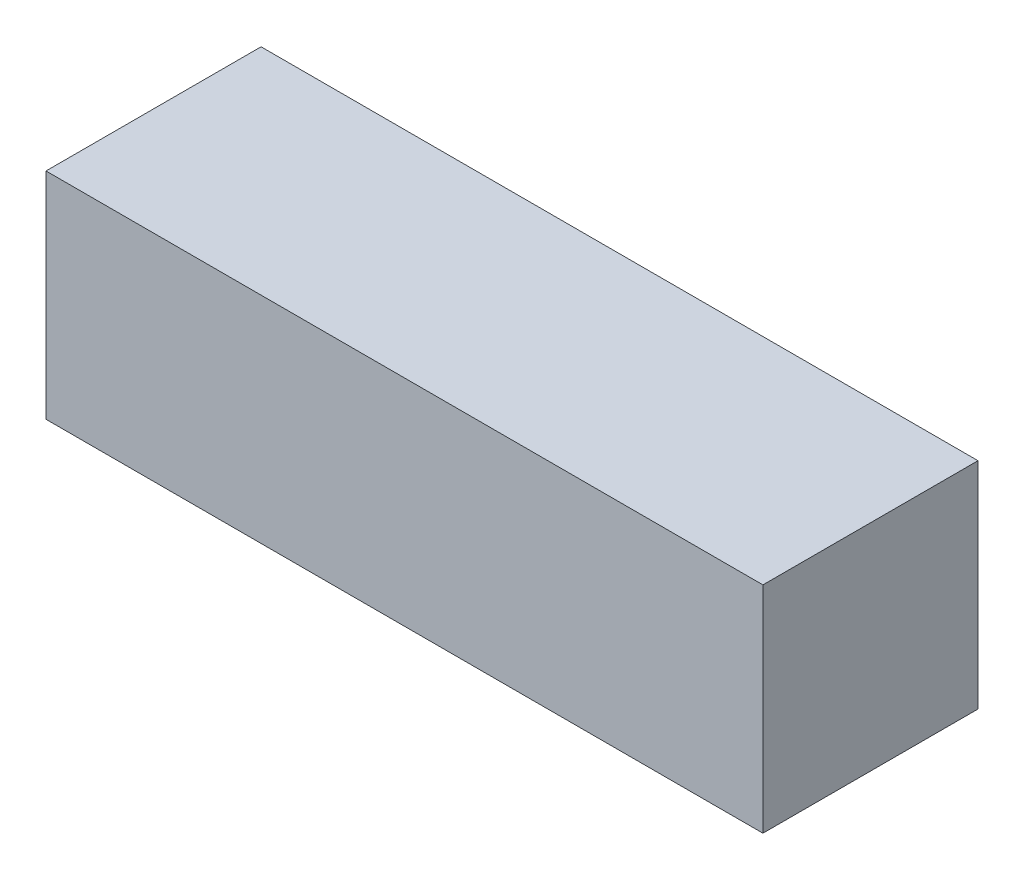
ISO-10303-21;
HEADER;
FILE_DESCRIPTION(('STEP AP214'),'2;1');
FILE_NAME('part.step','',(''),(''),'','','');
FILE_SCHEMA(('AUTOMOTIVE_DESIGN { 1 0 10303 214 1 1 1 1 }'));
ENDSEC;
DATA;
#1=APPLICATION_CONTEXT('core data for automotive mechanical design processes');
#2=APPLICATION_PROTOCOL_DEFINITION('international standard','automotive_design',2000,#1);
#3=PRODUCT_CONTEXT('',#1,'mechanical');
#4=PRODUCT('Part','Part','',(#3));
#5=PRODUCT_RELATED_PRODUCT_CATEGORY('part','',(#4));
#6=PRODUCT_DEFINITION_FORMATION('','',#4);
#7=PRODUCT_DEFINITION_CONTEXT('part definition',#1,'design');
#8=PRODUCT_DEFINITION('design','',#6,#7);
#9=PRODUCT_DEFINITION_SHAPE('','',#8);
#10=(LENGTH_UNIT() NAMED_UNIT(*) SI_UNIT(.MILLI.,.METRE.));
#11=(NAMED_UNIT(*) PLANE_ANGLE_UNIT() SI_UNIT($,.RADIAN.));
#12=(NAMED_UNIT(*) SI_UNIT($,.STERADIAN.) SOLID_ANGLE_UNIT());
#13=UNCERTAINTY_MEASURE_WITH_UNIT(LENGTH_MEASURE(1.E-05),#10,'distance_accuracy_value','');
#14=(GEOMETRIC_REPRESENTATION_CONTEXT(3) GLOBAL_UNCERTAINTY_ASSIGNED_CONTEXT((#13)) GLOBAL_UNIT_ASSIGNED_CONTEXT((#10,
#11,#12)) REPRESENTATION_CONTEXT('',''));
#15=CARTESIAN_POINT('',(0.,0.,0.));
#16=DIRECTION('',(0.,0.,1.));
#17=DIRECTION('',(1.,0.,0.));
#18=AXIS2_PLACEMENT_3D('',#15,#16,#17);
#19=CARTESIAN_POINT('',(100.,60.,30.));
#20=DIRECTION('',(-1.,0.,0.));
#21=DIRECTION('',(0.,0.,1.));
#22=AXIS2_PLACEMENT_3D('',#19,#20,#21);
#23=PLANE('',#22);
#24=DIRECTION('',(0.,0.,-1.));
#25=VECTOR('',#24,1.);
#26=CARTESIAN_POINT('',(100.,0.,30.));
#27=LINE('',#26,#25);
#28=CARTESIAN_POINT('',(100.,0.,30.));
#29=VERTEX_POINT('',#28);
#30=CARTESIAN_POINT('',(100.,0.,-30.));
#31=VERTEX_POINT('',#30);
#32=EDGE_CURVE('E113',#29,#31,#27,.T.);
#33=ORIENTED_EDGE('',*,*,#32,.T.);
#34=DIRECTION('',(0.,-1.,0.));
#35=VECTOR('',#34,1.);
#36=CARTESIAN_POINT('',(100.,60.,-30.));
#37=LINE('',#36,#35);
#38=CARTESIAN_POINT('',(100.,60.,-30.));
#39=VERTEX_POINT('',#38);
#40=EDGE_CURVE('E11',#39,#31,#37,.T.);
#41=ORIENTED_EDGE('',*,*,#40,.F.);
#42=DIRECTION('',(0.,0.,-1.));
#43=VECTOR('',#42,1.);
#44=CARTESIAN_POINT('',(100.,60.,30.));
#45=LINE('',#44,#43);
#46=CARTESIAN_POINT('',(100.,60.,30.));
#47=VERTEX_POINT('',#46);
#48=EDGE_CURVE('E97',#47,#39,#45,.T.);
#49=ORIENTED_EDGE('',*,*,#48,.F.);
#50=DIRECTION('',(0.,-1.,0.));
#51=VECTOR('',#50,1.);
#52=CARTESIAN_POINT('',(100.,60.,30.));
#53=LINE('',#52,#51);
#54=EDGE_CURVE('E109',#47,#29,#53,.T.);
#55=ORIENTED_EDGE('',*,*,#54,.T.);
#56=EDGE_LOOP('',(#33,#41,#49,#55));
#57=FACE_BOUND('',#56,.T.);
#58=ADVANCED_FACE('F45',(#57),#23,.F.);
#59=CARTESIAN_POINT('',(-100.,60.,-30.));
#60=DIRECTION('',(0.,0.,1.));
#61=DIRECTION('',(1.,0.,0.));
#62=AXIS2_PLACEMENT_3D('',#59,#60,#61);
#63=PLANE('',#62);
#64=DIRECTION('',(-1.,0.,0.));
#65=VECTOR('',#64,1.);
#66=CARTESIAN_POINT('',(-100.,0.,-30.));
#67=LINE('',#66,#65);
#68=CARTESIAN_POINT('',(-100.,0.,-30.));
#69=VERTEX_POINT('',#68);
#70=EDGE_CURVE('E102',#31,#69,#67,.T.);
#71=ORIENTED_EDGE('',*,*,#70,.T.);
#72=DIRECTION('',(0.,-1.,0.));
#73=VECTOR('',#72,1.);
#74=CARTESIAN_POINT('',(-100.,60.,-30.));
#75=LINE('',#74,#73);
#76=CARTESIAN_POINT('',(-100.,60.,-30.));
#77=VERTEX_POINT('',#76);
#78=EDGE_CURVE('E54',#77,#69,#75,.T.);
#79=ORIENTED_EDGE('',*,*,#78,.F.);
#80=DIRECTION('',(-1.,0.,0.));
#81=VECTOR('',#80,1.);
#82=CARTESIAN_POINT('',(-100.,60.,-30.));
#83=LINE('',#82,#81);
#84=EDGE_CURVE('E92',#39,#77,#83,.T.);
#85=ORIENTED_EDGE('',*,*,#84,.F.);
#86=ORIENTED_EDGE('',*,*,#40,.T.);
#87=EDGE_LOOP('',(#71,#79,#85,#86));
#88=FACE_BOUND('',#87,.T.);
#89=ADVANCED_FACE('F101',(#88),#63,.F.);
#90=CARTESIAN_POINT('',(-100.,60.,30.));
#91=DIRECTION('',(1.,0.,0.));
#92=DIRECTION('',(0.,0.,-1.));
#93=AXIS2_PLACEMENT_3D('',#90,#91,#92);
#94=PLANE('',#93);
#95=DIRECTION('',(0.,0.,1.));
#96=VECTOR('',#95,1.);
#97=CARTESIAN_POINT('',(-100.,0.,30.));
#98=LINE('',#97,#96);
#99=CARTESIAN_POINT('',(-100.,0.,30.));
#100=VERTEX_POINT('',#99);
#101=EDGE_CURVE('E79',#69,#100,#98,.T.);
#102=ORIENTED_EDGE('',*,*,#101,.T.);
#103=DIRECTION('',(0.,-1.,0.));
#104=VECTOR('',#103,1.);
#105=CARTESIAN_POINT('',(-100.,60.,30.));
#106=LINE('',#105,#104);
#107=CARTESIAN_POINT('',(-100.,60.,30.));
#108=VERTEX_POINT('',#107);
#109=EDGE_CURVE('E104',#108,#100,#106,.T.);
#110=ORIENTED_EDGE('',*,*,#109,.F.);
#111=DIRECTION('',(0.,0.,1.));
#112=VECTOR('',#111,1.);
#113=CARTESIAN_POINT('',(-100.,60.,30.));
#114=LINE('',#113,#112);
#115=EDGE_CURVE('E95',#77,#108,#114,.T.);
#116=ORIENTED_EDGE('',*,*,#115,.F.);
#117=ORIENTED_EDGE('',*,*,#78,.T.);
#118=EDGE_LOOP('',(#102,#110,#116,#117));
#119=FACE_BOUND('',#118,.T.);
#120=ADVANCED_FACE('F105',(#119),#94,.F.);
#121=CARTESIAN_POINT('',(-100.,60.,30.));
#122=DIRECTION('',(0.,0.,-1.));
#123=DIRECTION('',(-1.,0.,0.));
#124=AXIS2_PLACEMENT_3D('',#121,#122,#123);
#125=PLANE('',#124);
#126=DIRECTION('',(1.,0.,0.));
#127=VECTOR('',#126,1.);
#128=CARTESIAN_POINT('',(-100.,0.,30.));
#129=LINE('',#128,#127);
#130=EDGE_CURVE('E85',#100,#29,#129,.T.);
#131=ORIENTED_EDGE('',*,*,#130,.T.);
#132=ORIENTED_EDGE('',*,*,#54,.F.);
#133=DIRECTION('',(1.,0.,0.));
#134=VECTOR('',#133,1.);
#135=CARTESIAN_POINT('',(-100.,60.,30.));
#136=LINE('',#135,#134);
#137=EDGE_CURVE('E62',#108,#47,#136,.T.);
#138=ORIENTED_EDGE('',*,*,#137,.F.);
#139=ORIENTED_EDGE('',*,*,#109,.T.);
#140=EDGE_LOOP('',(#131,#132,#138,#139));
#141=FACE_BOUND('',#140,.T.);
#142=ADVANCED_FACE('F126',(#141),#125,.F.);
#143=CARTESIAN_POINT('',(0.,60.,0.));
#144=DIRECTION('',(0.,-1.,0.));
#145=DIRECTION('',(0.,0.,-1.));
#146=AXIS2_PLACEMENT_3D('',#143,#144,#145);
#147=PLANE('',#146);
#148=ORIENTED_EDGE('',*,*,#48,.T.);
#149=ORIENTED_EDGE('',*,*,#84,.T.);
#150=ORIENTED_EDGE('',*,*,#115,.T.);
#151=ORIENTED_EDGE('',*,*,#137,.T.);
#152=EDGE_LOOP('',(#148,#149,#150,#151));
#153=FACE_BOUND('',#152,.T.);
#154=ADVANCED_FACE('F93',(#153),#147,.F.);
#155=CARTESIAN_POINT('',(0.,0.,0.));
#156=DIRECTION('',(0.,-1.,0.));
#157=DIRECTION('',(0.,0.,-1.));
#158=AXIS2_PLACEMENT_3D('',#155,#156,#157);
#159=PLANE('',#158);
#160=ORIENTED_EDGE('',*,*,#32,.F.);
#161=ORIENTED_EDGE('',*,*,#130,.F.);
#162=ORIENTED_EDGE('',*,*,#101,.F.);
#163=ORIENTED_EDGE('',*,*,#70,.F.);
#164=EDGE_LOOP('',(#160,#161,#162,#163));
#165=FACE_BOUND('',#164,.T.);
#166=ADVANCED_FACE('F129',(#165),#159,.T.);
#167=CLOSED_SHELL('',(#58,#89,#120,#142,#154,#166));
#168=MANIFOLD_SOLID_BREP('B2',#167);
#169=ADVANCED_BREP_SHAPE_REPRESENTATION('',(#18,#168),#14);
#170=SHAPE_DEFINITION_REPRESENTATION(#9,#169);
ENDSEC;
END-ISO-10303-21;
